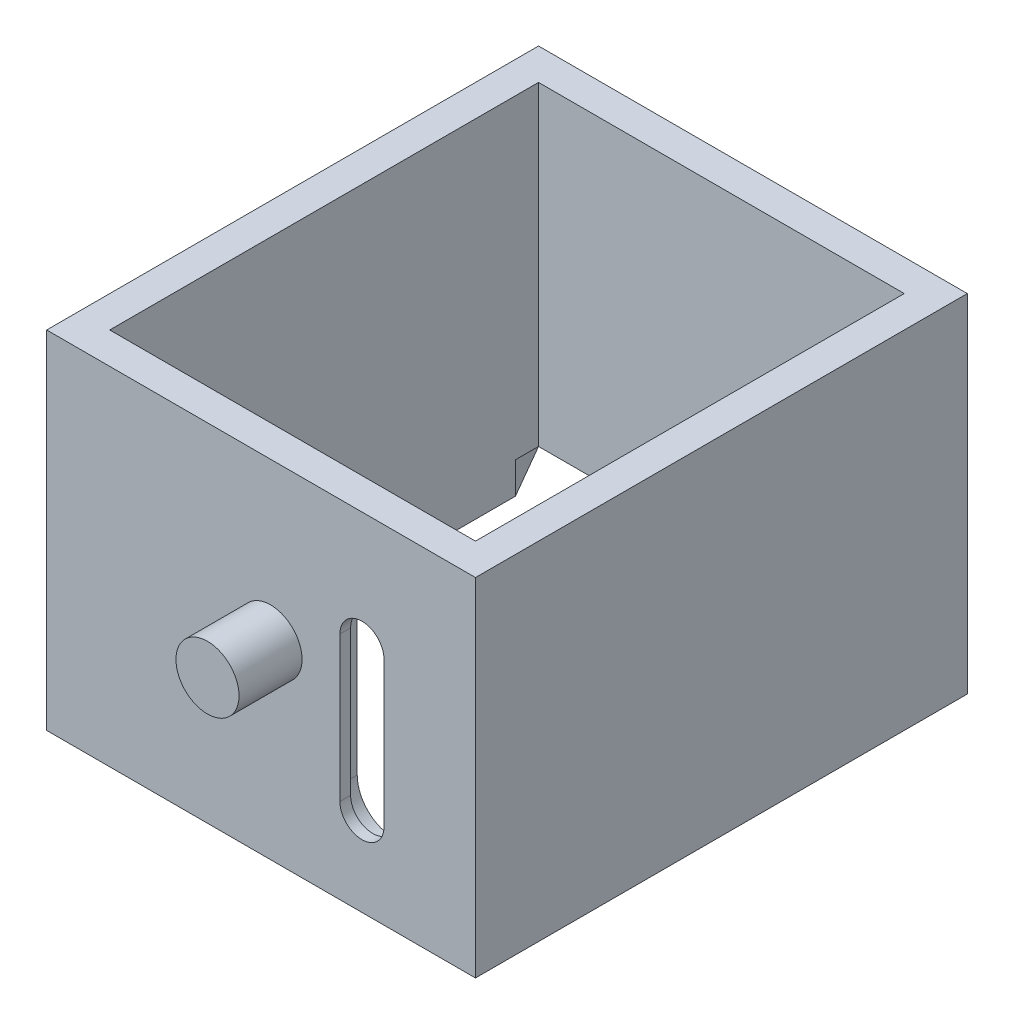
ISO-10303-21;
HEADER;
FILE_DESCRIPTION(('STEP AP214'),'2;1');
FILE_NAME('part.step','',(''),(''),'','','');
FILE_SCHEMA(('AUTOMOTIVE_DESIGN { 1 0 10303 214 1 1 1 1 }'));
ENDSEC;
DATA;
#1=APPLICATION_CONTEXT('core data for automotive mechanical design processes');
#2=APPLICATION_PROTOCOL_DEFINITION('international standard','automotive_design',2000,#1);
#3=PRODUCT_CONTEXT('',#1,'mechanical');
#4=PRODUCT('Part','Part','',(#3));
#5=PRODUCT_RELATED_PRODUCT_CATEGORY('part','',(#4));
#6=PRODUCT_DEFINITION_FORMATION('','',#4);
#7=PRODUCT_DEFINITION_CONTEXT('part definition',#1,'design');
#8=PRODUCT_DEFINITION('design','',#6,#7);
#9=PRODUCT_DEFINITION_SHAPE('','',#8);
#10=(LENGTH_UNIT() NAMED_UNIT(*) SI_UNIT(.MILLI.,.METRE.));
#11=(NAMED_UNIT(*) PLANE_ANGLE_UNIT() SI_UNIT($,.RADIAN.));
#12=(NAMED_UNIT(*) SI_UNIT($,.STERADIAN.) SOLID_ANGLE_UNIT());
#13=UNCERTAINTY_MEASURE_WITH_UNIT(LENGTH_MEASURE(1.E-05),#10,'distance_accuracy_value','');
#14=(GEOMETRIC_REPRESENTATION_CONTEXT(3) GLOBAL_UNCERTAINTY_ASSIGNED_CONTEXT((#13)) GLOBAL_UNIT_ASSIGNED_CONTEXT((#10,
#11,#12)) REPRESENTATION_CONTEXT('',''));
#15=CARTESIAN_POINT('',(0.,0.,0.));
#16=DIRECTION('',(0.,0.,1.));
#17=DIRECTION('',(1.,0.,0.));
#18=AXIS2_PLACEMENT_3D('',#15,#16,#17);
#19=CARTESIAN_POINT('',(0.,0.,0.));
#20=DIRECTION('',(0.,0.,1.));
#21=DIRECTION('',(1.,0.,0.));
#22=AXIS2_PLACEMENT_3D('',#19,#20,#21);
#23=PLANE('',#22);
#24=DIRECTION('',(1.,0.,0.));
#25=VECTOR('',#24,1.);
#26=CARTESIAN_POINT('',(-68.,5.,0.));
#27=LINE('',#26,#25);
#28=CARTESIAN_POINT('',(-68.,5.,0.));
#29=VERTEX_POINT('',#28);
#30=CARTESIAN_POINT('',(0.,5.,0.));
#31=VERTEX_POINT('',#30);
#32=EDGE_CURVE('E244',#29,#31,#27,.T.);
#33=ORIENTED_EDGE('',*,*,#32,.F.);
#34=DIRECTION('',(0.,-1.,0.));
#35=VECTOR('',#34,1.);
#36=CARTESIAN_POINT('',(-68.,55.,0.));
#37=LINE('',#36,#35);
#38=CARTESIAN_POINT('',(-68.,55.,0.));
#39=VERTEX_POINT('',#38);
#40=EDGE_CURVE('E268',#39,#29,#37,.T.);
#41=ORIENTED_EDGE('',*,*,#40,.F.);
#42=DIRECTION('',(-1.,0.,0.));
#43=VECTOR('',#42,1.);
#44=CARTESIAN_POINT('',(-68.,55.,0.));
#45=LINE('',#44,#43);
#46=CARTESIAN_POINT('',(0.,55.,0.));
#47=VERTEX_POINT('',#46);
#48=EDGE_CURVE('E258',#47,#39,#45,.T.);
#49=ORIENTED_EDGE('',*,*,#48,.F.);
#50=DIRECTION('',(0.,1.,0.));
#51=VECTOR('',#50,1.);
#52=CARTESIAN_POINT('',(0.,55.,0.));
#53=LINE('',#52,#51);
#54=EDGE_CURVE('E257',#31,#47,#53,.T.);
#55=ORIENTED_EDGE('',*,*,#54,.F.);
#56=EDGE_LOOP('',(#33,#41,#49,#55));
#57=FACE_BOUND('',#56,.T.);
#58=ADVANCED_FACE('F106',(#57),#23,.F.);
#59=CARTESIAN_POINT('',(-63.,0.,5.));
#60=DIRECTION('',(0.,0.,-1.));
#61=DIRECTION('',(-1.,0.,0.));
#62=AXIS2_PLACEMENT_3D('',#59,#60,#61);
#63=PLANE('',#62);
#64=DIRECTION('',(-1.,0.,0.));
#65=VECTOR('',#64,1.);
#66=CARTESIAN_POINT('',(-63.,5.,5.));
#67=LINE('',#66,#65);
#68=CARTESIAN_POINT('',(-5.,5.,5.));
#69=VERTEX_POINT('',#68);
#70=CARTESIAN_POINT('',(-63.,5.,5.));
#71=VERTEX_POINT('',#70);
#72=EDGE_CURVE('E403',#69,#71,#67,.T.);
#73=ORIENTED_EDGE('',*,*,#72,.F.);
#74=DIRECTION('',(0.,1.,0.));
#75=VECTOR('',#74,1.);
#76=CARTESIAN_POINT('',(-5.,0.,5.));
#77=LINE('',#76,#75);
#78=CARTESIAN_POINT('',(-5.,55.,5.));
#79=VERTEX_POINT('',#78);
#80=EDGE_CURVE('E354',#69,#79,#77,.T.);
#81=ORIENTED_EDGE('',*,*,#80,.T.);
#82=DIRECTION('',(-1.,0.,0.));
#83=VECTOR('',#82,1.);
#84=CARTESIAN_POINT('',(-63.,55.,5.));
#85=LINE('',#84,#83);
#86=CARTESIAN_POINT('',(-63.,55.,5.));
#87=VERTEX_POINT('',#86);
#88=EDGE_CURVE('E337',#79,#87,#85,.T.);
#89=ORIENTED_EDGE('',*,*,#88,.T.);
#90=DIRECTION('',(0.,1.,0.));
#91=VECTOR('',#90,1.);
#92=CARTESIAN_POINT('',(-63.,0.,5.));
#93=LINE('',#92,#91);
#94=EDGE_CURVE('E262',#71,#87,#93,.T.);
#95=ORIENTED_EDGE('',*,*,#94,.F.);
#96=EDGE_LOOP('',(#73,#81,#89,#95));
#97=FACE_BOUND('',#96,.T.);
#98=ADVANCED_FACE('F456',(#97),#63,.F.);
#99=CARTESIAN_POINT('',(-63.,0.,73.));
#100=DIRECTION('',(0.,0.,1.));
#101=DIRECTION('',(1.,0.,0.));
#102=AXIS2_PLACEMENT_3D('',#99,#100,#101);
#103=PLANE('',#102);
#104=DIRECTION('',(1.,0.,0.));
#105=VECTOR('',#104,1.);
#106=CARTESIAN_POINT('',(-63.,55.,73.));
#107=LINE('',#106,#105);
#108=CARTESIAN_POINT('',(-63.,55.,73.));
#109=VERTEX_POINT('',#108);
#110=CARTESIAN_POINT('',(-4.99999999999999,55.,73.));
#111=VERTEX_POINT('',#110);
#112=EDGE_CURVE('E345',#109,#111,#107,.T.);
#113=ORIENTED_EDGE('',*,*,#112,.T.);
#114=DIRECTION('',(0.,1.,0.));
#115=VECTOR('',#114,1.);
#116=CARTESIAN_POINT('',(-4.99999999999999,0.,73.));
#117=LINE('',#116,#115);
#118=CARTESIAN_POINT('',(-4.99999999999999,0.,73.));
#119=VERTEX_POINT('',#118);
#120=EDGE_CURVE('E356',#119,#111,#117,.T.);
#121=ORIENTED_EDGE('',*,*,#120,.F.);
#122=DIRECTION('',(1.,0.,0.));
#123=VECTOR('',#122,1.);
#124=CARTESIAN_POINT('',(-63.,0.,73.));
#125=LINE('',#124,#123);
#126=CARTESIAN_POINT('',(-63.,0.,73.));
#127=VERTEX_POINT('',#126);
#128=EDGE_CURVE('E336',#127,#119,#125,.T.);
#129=ORIENTED_EDGE('',*,*,#128,.F.);
#130=DIRECTION('',(0.,1.,0.));
#131=VECTOR('',#130,1.);
#132=CARTESIAN_POINT('',(-63.,0.,73.));
#133=LINE('',#132,#131);
#134=EDGE_CURVE('E343',#127,#109,#133,.T.);
#135=ORIENTED_EDGE('',*,*,#134,.T.);
#136=EDGE_LOOP('',(#113,#121,#129,#135));
#137=FACE_BOUND('',#136,.T.);
#138=DIRECTION('',(0.,1.,0.));
#139=VECTOR('',#138,1.);
#140=CARTESIAN_POINT('',(-12.25,13.5,73.));
#141=LINE('',#140,#139);
#142=CARTESIAN_POINT('',(-12.25,13.5,73.));
#143=VERTEX_POINT('',#142);
#144=CARTESIAN_POINT('',(-12.25,36.5,73.));
#145=VERTEX_POINT('',#144);
#146=EDGE_CURVE('E418',#143,#145,#141,.T.);
#147=ORIENTED_EDGE('',*,*,#146,.T.);
#148=CARTESIAN_POINT('',(-18.,36.5,73.));
#149=DIRECTION('',(0.,0.,-1.));
#150=DIRECTION('',(-1.,0.,0.));
#151=AXIS2_PLACEMENT_3D('',#148,#149,#150);
#152=CIRCLE('',#151,5.75);
#153=CARTESIAN_POINT('',(-23.7500000000001,36.5,73.));
#154=VERTEX_POINT('',#153);
#155=EDGE_CURVE('E312',#154,#145,#152,.T.);
#156=ORIENTED_EDGE('',*,*,#155,.F.);
#157=DIRECTION('',(0.,1.,0.));
#158=VECTOR('',#157,1.);
#159=CARTESIAN_POINT('',(-23.7500000000001,13.5,73.));
#160=LINE('',#159,#158);
#161=CARTESIAN_POINT('',(-23.75,13.5,73.));
#162=VERTEX_POINT('',#161);
#163=EDGE_CURVE('E407',#162,#154,#160,.T.);
#164=ORIENTED_EDGE('',*,*,#163,.F.);
#165=CARTESIAN_POINT('',(-18.,13.5,73.));
#166=DIRECTION('',(0.,0.,-1.));
#167=DIRECTION('',(-1.,0.,0.));
#168=AXIS2_PLACEMENT_3D('',#165,#166,#167);
#169=CIRCLE('',#168,5.75);
#170=EDGE_CURVE('E128',#143,#162,#169,.T.);
#171=ORIENTED_EDGE('',*,*,#170,.F.);
#172=EDGE_LOOP('',(#147,#156,#164,#171));
#173=FACE_BOUND('',#172,.T.);
#174=ADVANCED_FACE('F393',(#137,#173),#103,.F.);
#175=CARTESIAN_POINT('',(0.,0.,78.));
#176=DIRECTION('',(0.,0.,1.));
#177=DIRECTION('',(1.,0.,0.));
#178=AXIS2_PLACEMENT_3D('',#175,#176,#177);
#179=PLANE('',#178);
#180=CARTESIAN_POINT('',(-32.5,30.,78.));
#181=DIRECTION('',(0.,0.,1.));
#182=DIRECTION('',(1.,0.,0.));
#183=AXIS2_PLACEMENT_3D('',#180,#181,#182);
#184=CIRCLE('',#183,5.);
#185=CARTESIAN_POINT('',(-27.5,30.,78.));
#186=VERTEX_POINT('',#185);
#187=EDGE_CURVE('E327',#186,#186,#184,.T.);
#188=ORIENTED_EDGE('',*,*,#187,.F.);
#189=EDGE_LOOP('',(#188));
#190=FACE_BOUND('',#189,.T.);
#191=DIRECTION('',(0.,1.,0.));
#192=VECTOR('',#191,1.);
#193=CARTESIAN_POINT('',(0.,55.,78.));
#194=LINE('',#193,#192);
#195=CARTESIAN_POINT('',(0.,0.,78.));
#196=VERTEX_POINT('',#195);
#197=CARTESIAN_POINT('',(0.,55.,78.));
#198=VERTEX_POINT('',#197);
#199=EDGE_CURVE('E275',#196,#198,#194,.T.);
#200=ORIENTED_EDGE('',*,*,#199,.T.);
#201=DIRECTION('',(-1.,0.,0.));
#202=VECTOR('',#201,1.);
#203=CARTESIAN_POINT('',(-68.,55.,78.));
#204=LINE('',#203,#202);
#205=CARTESIAN_POINT('',(-68.,55.,78.));
#206=VERTEX_POINT('',#205);
#207=EDGE_CURVE('E362',#198,#206,#204,.T.);
#208=ORIENTED_EDGE('',*,*,#207,.T.);
#209=DIRECTION('',(0.,-1.,0.));
#210=VECTOR('',#209,1.);
#211=CARTESIAN_POINT('',(-68.,55.,78.));
#212=LINE('',#211,#210);
#213=CARTESIAN_POINT('',(-68.,0.,78.));
#214=VERTEX_POINT('',#213);
#215=EDGE_CURVE('E363',#206,#214,#212,.T.);
#216=ORIENTED_EDGE('',*,*,#215,.T.);
#217=DIRECTION('',(1.,0.,0.));
#218=VECTOR('',#217,1.);
#219=CARTESIAN_POINT('',(-68.,0.,78.));
#220=LINE('',#219,#218);
#221=EDGE_CURVE('E271',#214,#196,#220,.T.);
#222=ORIENTED_EDGE('',*,*,#221,.T.);
#223=EDGE_LOOP('',(#200,#208,#216,#222));
#224=FACE_BOUND('',#223,.T.);
#225=CARTESIAN_POINT('',(-18.,36.5,78.));
#226=DIRECTION('',(0.,0.,1.));
#227=DIRECTION('',(1.,0.,0.));
#228=AXIS2_PLACEMENT_3D('',#225,#226,#227);
#229=CIRCLE('',#228,3.5);
#230=CARTESIAN_POINT('',(-14.5,36.5,78.));
#231=VERTEX_POINT('',#230);
#232=CARTESIAN_POINT('',(-21.5,36.5,78.));
#233=VERTEX_POINT('',#232);
#234=EDGE_CURVE('E290',#231,#233,#229,.T.);
#235=ORIENTED_EDGE('',*,*,#234,.F.);
#236=DIRECTION('',(0.,-1.,0.));
#237=VECTOR('',#236,1.);
#238=CARTESIAN_POINT('',(-14.5,0.,78.));
#239=LINE('',#238,#237);
#240=CARTESIAN_POINT('',(-14.5,13.5,78.));
#241=VERTEX_POINT('',#240);
#242=EDGE_CURVE('E114',#231,#241,#239,.T.);
#243=ORIENTED_EDGE('',*,*,#242,.T.);
#244=CARTESIAN_POINT('',(-18.,13.5,78.));
#245=DIRECTION('',(0.,0.,1.));
#246=DIRECTION('',(1.,0.,0.));
#247=AXIS2_PLACEMENT_3D('',#244,#245,#246);
#248=CIRCLE('',#247,3.5);
#249=CARTESIAN_POINT('',(-21.5,13.5,78.));
#250=VERTEX_POINT('',#249);
#251=EDGE_CURVE('E288',#250,#241,#248,.T.);
#252=ORIENTED_EDGE('',*,*,#251,.F.);
#253=DIRECTION('',(0.,-1.,0.));
#254=VECTOR('',#253,1.);
#255=CARTESIAN_POINT('',(-21.5,0.,78.));
#256=LINE('',#255,#254);
#257=EDGE_CURVE('E285',#233,#250,#256,.T.);
#258=ORIENTED_EDGE('',*,*,#257,.F.);
#259=EDGE_LOOP('',(#235,#243,#252,#258));
#260=FACE_BOUND('',#259,.T.);
#261=ADVANCED_FACE('F295',(#190,#224,#260),#179,.T.);
#262=CARTESIAN_POINT('',(0.,55.,78.));
#263=DIRECTION('',(-1.,0.,0.));
#264=DIRECTION('',(0.,-1.,0.));
#265=AXIS2_PLACEMENT_3D('',#262,#263,#264);
#266=PLANE('',#265);
#267=CARTESIAN_POINT('',(0.,0.,0.));
#268=VERTEX_POINT('',#267);
#269=EDGE_CURVE('E238',#268,#31,#53,.T.);
#270=ORIENTED_EDGE('',*,*,#269,.T.);
#271=ORIENTED_EDGE('',*,*,#54,.T.);
#272=DIRECTION('',(0.,0.,-1.));
#273=VECTOR('',#272,1.);
#274=CARTESIAN_POINT('',(0.,55.,78.));
#275=LINE('',#274,#273);
#276=EDGE_CURVE('E283',#198,#47,#275,.T.);
#277=ORIENTED_EDGE('',*,*,#276,.F.);
#278=ORIENTED_EDGE('',*,*,#199,.F.);
#279=DIRECTION('',(0.,0.,-1.));
#280=VECTOR('',#279,1.);
#281=CARTESIAN_POINT('',(0.,0.,78.));
#282=LINE('',#281,#280);
#283=EDGE_CURVE('E267',#196,#268,#282,.T.);
#284=ORIENTED_EDGE('',*,*,#283,.T.);
#285=EDGE_LOOP('',(#270,#271,#277,#278,#284));
#286=FACE_BOUND('',#285,.T.);
#287=ADVANCED_FACE('F108',(#286),#266,.F.);
#288=CARTESIAN_POINT('',(-68.,55.,78.));
#289=DIRECTION('',(0.,-1.,0.));
#290=DIRECTION('',(0.,0.,-1.));
#291=AXIS2_PLACEMENT_3D('',#288,#289,#290);
#292=PLANE('',#291);
#293=ORIENTED_EDGE('',*,*,#112,.F.);
#294=DIRECTION('',(0.,0.,1.));
#295=VECTOR('',#294,1.);
#296=CARTESIAN_POINT('',(-63.,55.,5.));
#297=LINE('',#296,#295);
#298=EDGE_CURVE('E331',#87,#109,#297,.T.);
#299=ORIENTED_EDGE('',*,*,#298,.F.);
#300=ORIENTED_EDGE('',*,*,#88,.F.);
#301=DIRECTION('',(0.,0.,-1.));
#302=VECTOR('',#301,1.);
#303=CARTESIAN_POINT('',(-5.,55.,5.));
#304=LINE('',#303,#302);
#305=EDGE_CURVE('E348',#111,#79,#304,.T.);
#306=ORIENTED_EDGE('',*,*,#305,.F.);
#307=EDGE_LOOP('',(#293,#299,#300,#306));
#308=FACE_BOUND('',#307,.T.);
#309=ORIENTED_EDGE('',*,*,#48,.T.);
#310=DIRECTION('',(0.,0.,-1.));
#311=VECTOR('',#310,1.);
#312=CARTESIAN_POINT('',(-68.,55.,78.));
#313=LINE('',#312,#311);
#314=EDGE_CURVE('E280',#206,#39,#313,.T.);
#315=ORIENTED_EDGE('',*,*,#314,.F.);
#316=ORIENTED_EDGE('',*,*,#207,.F.);
#317=ORIENTED_EDGE('',*,*,#276,.T.);
#318=EDGE_LOOP('',(#309,#315,#316,#317));
#319=FACE_BOUND('',#318,.T.);
#320=ADVANCED_FACE('F372',(#308,#319),#292,.F.);
#321=CARTESIAN_POINT('',(-68.,55.,78.));
#322=DIRECTION('',(1.,0.,0.));
#323=DIRECTION('',(0.,0.,-1.));
#324=AXIS2_PLACEMENT_3D('',#321,#322,#323);
#325=PLANE('',#324);
#326=ORIENTED_EDGE('',*,*,#40,.T.);
#327=DIRECTION('',(0.,-1.,0.));
#328=VECTOR('',#327,1.);
#329=CARTESIAN_POINT('',(-68.,5.,0.));
#330=LINE('',#329,#328);
#331=CARTESIAN_POINT('',(-68.,0.,0.));
#332=VERTEX_POINT('',#331);
#333=EDGE_CURVE('E377',#29,#332,#330,.T.);
#334=ORIENTED_EDGE('',*,*,#333,.T.);
#335=DIRECTION('',(0.,0.,-1.));
#336=VECTOR('',#335,1.);
#337=CARTESIAN_POINT('',(-68.,0.,78.));
#338=LINE('',#337,#336);
#339=EDGE_CURVE('E277',#214,#332,#338,.T.);
#340=ORIENTED_EDGE('',*,*,#339,.F.);
#341=ORIENTED_EDGE('',*,*,#215,.F.);
#342=ORIENTED_EDGE('',*,*,#314,.T.);
#343=EDGE_LOOP('',(#326,#334,#340,#341,#342));
#344=FACE_BOUND('',#343,.T.);
#345=ADVANCED_FACE('F375',(#344),#325,.F.);
#346=CARTESIAN_POINT('',(-68.,0.,78.));
#347=DIRECTION('',(0.,1.,0.));
#348=DIRECTION('',(0.,0.,1.));
#349=AXIS2_PLACEMENT_3D('',#346,#347,#348);
#350=PLANE('',#349);
#351=ORIENTED_EDGE('',*,*,#339,.T.);
#352=DIRECTION('',(-0.5,0.,-0.866025403784438));
#353=VECTOR('',#352,1.);
#354=CARTESIAN_POINT('',(-63.,0.,8.66025403784439));
#355=LINE('',#354,#353);
#356=CARTESIAN_POINT('',(-63.,0.,8.66025403784439));
#357=VERTEX_POINT('',#356);
#358=EDGE_CURVE('E254',#357,#332,#355,.T.);
#359=ORIENTED_EDGE('',*,*,#358,.F.);
#360=DIRECTION('',(0.,0.,1.));
#361=VECTOR('',#360,1.);
#362=CARTESIAN_POINT('',(-63.,0.,5.));
#363=LINE('',#362,#361);
#364=EDGE_CURVE('E334',#357,#127,#363,.T.);
#365=ORIENTED_EDGE('',*,*,#364,.T.);
#366=ORIENTED_EDGE('',*,*,#128,.T.);
#367=DIRECTION('',(0.,0.,-1.));
#368=VECTOR('',#367,1.);
#369=CARTESIAN_POINT('',(-5.,0.,5.));
#370=LINE('',#369,#368);
#371=CARTESIAN_POINT('',(-4.99999999999999,0.,8.66025403784439));
#372=VERTEX_POINT('',#371);
#373=EDGE_CURVE('E340',#119,#372,#370,.T.);
#374=ORIENTED_EDGE('',*,*,#373,.T.);
#375=DIRECTION('',(-0.499999999999999,0.,0.866025403784439));
#376=VECTOR('',#375,1.);
#377=CARTESIAN_POINT('',(0.,0.,0.));
#378=LINE('',#377,#376);
#379=EDGE_CURVE('E370',#268,#372,#378,.T.);
#380=ORIENTED_EDGE('',*,*,#379,.F.);
#381=ORIENTED_EDGE('',*,*,#283,.F.);
#382=ORIENTED_EDGE('',*,*,#221,.F.);
#383=EDGE_LOOP('',(#351,#359,#365,#366,#374,#380,#381,#382));
#384=FACE_BOUND('',#383,.T.);
#385=ADVANCED_FACE('F369',(#384),#350,.F.);
#386=CARTESIAN_POINT('',(-63.,0.,5.));
#387=DIRECTION('',(-1.,0.,0.));
#388=DIRECTION('',(0.,0.,1.));
#389=AXIS2_PLACEMENT_3D('',#386,#387,#388);
#390=PLANE('',#389);
#391=ORIENTED_EDGE('',*,*,#364,.F.);
#392=DIRECTION('',(0.,-1.,0.));
#393=VECTOR('',#392,1.);
#394=CARTESIAN_POINT('',(-63.,5.,8.66025403784439));
#395=LINE('',#394,#393);
#396=CARTESIAN_POINT('',(-63.,5.,8.66025403784439));
#397=VERTEX_POINT('',#396);
#398=EDGE_CURVE('E387',#397,#357,#395,.T.);
#399=ORIENTED_EDGE('',*,*,#398,.F.);
#400=DIRECTION('',(0.,0.,1.));
#401=VECTOR('',#400,1.);
#402=CARTESIAN_POINT('',(-63.,5.,5.));
#403=LINE('',#402,#401);
#404=EDGE_CURVE('E405',#71,#397,#403,.T.);
#405=ORIENTED_EDGE('',*,*,#404,.F.);
#406=ORIENTED_EDGE('',*,*,#94,.T.);
#407=ORIENTED_EDGE('',*,*,#298,.T.);
#408=ORIENTED_EDGE('',*,*,#134,.F.);
#409=EDGE_LOOP('',(#391,#399,#405,#406,#407,#408));
#410=FACE_BOUND('',#409,.T.);
#411=ADVANCED_FACE('F385',(#410),#390,.F.);
#412=CARTESIAN_POINT('',(-5.,0.,5.));
#413=DIRECTION('',(1.,0.,0.));
#414=DIRECTION('',(0.,0.,-1.));
#415=AXIS2_PLACEMENT_3D('',#412,#413,#414);
#416=PLANE('',#415);
#417=DIRECTION('',(0.,0.,-1.));
#418=VECTOR('',#417,1.);
#419=CARTESIAN_POINT('',(-5.,5.,5.));
#420=LINE('',#419,#418);
#421=CARTESIAN_POINT('',(-5.,5.,8.66025403784439));
#422=VERTEX_POINT('',#421);
#423=EDGE_CURVE('E13',#422,#69,#420,.T.);
#424=ORIENTED_EDGE('',*,*,#423,.F.);
#425=DIRECTION('',(0.,-1.,0.));
#426=VECTOR('',#425,1.);
#427=CARTESIAN_POINT('',(-4.99999999999999,5.,8.66025403784439));
#428=LINE('',#427,#426);
#429=EDGE_CURVE('E241',#422,#372,#428,.T.);
#430=ORIENTED_EDGE('',*,*,#429,.T.);
#431=ORIENTED_EDGE('',*,*,#373,.F.);
#432=ORIENTED_EDGE('',*,*,#120,.T.);
#433=ORIENTED_EDGE('',*,*,#305,.T.);
#434=ORIENTED_EDGE('',*,*,#80,.F.);
#435=EDGE_LOOP('',(#424,#430,#431,#432,#433,#434));
#436=FACE_BOUND('',#435,.T.);
#437=ADVANCED_FACE('F396',(#436),#416,.F.);
#438=CARTESIAN_POINT('',(-32.5,30.,88.));
#439=DIRECTION('',(0.,0.,-1.));
#440=DIRECTION('',(-1.,0.,0.));
#441=AXIS2_PLACEMENT_3D('',#438,#439,#440);
#442=CYLINDRICAL_SURFACE('',#441,5.);
#443=CARTESIAN_POINT('',(-32.5,30.,88.));
#444=DIRECTION('',(0.,0.,1.));
#445=DIRECTION('',(1.,0.,0.));
#446=AXIS2_PLACEMENT_3D('',#443,#444,#445);
#447=CIRCLE('',#446,5.);
#448=CARTESIAN_POINT('',(-27.5,30.,88.));
#449=VERTEX_POINT('',#448);
#450=EDGE_CURVE('E328',#449,#449,#447,.T.);
#451=ORIENTED_EDGE('',*,*,#450,.F.);
#452=EDGE_LOOP('',(#451));
#453=FACE_BOUND('',#452,.T.);
#454=ORIENTED_EDGE('',*,*,#187,.T.);
#455=EDGE_LOOP('',(#454));
#456=FACE_BOUND('',#455,.T.);
#457=ADVANCED_FACE('F518',(#453,#456),#442,.T.);
#458=CARTESIAN_POINT('',(-32.5,30.,88.));
#459=DIRECTION('',(0.,0.,1.));
#460=DIRECTION('',(1.,0.,0.));
#461=AXIS2_PLACEMENT_3D('',#458,#459,#460);
#462=PLANE('',#461);
#463=ORIENTED_EDGE('',*,*,#450,.T.);
#464=EDGE_LOOP('',(#463));
#465=FACE_BOUND('',#464,.T.);
#466=ADVANCED_FACE('F451',(#465),#462,.T.);
#467=CARTESIAN_POINT('',(-18.,36.5,73.));
#468=DIRECTION('',(0.,0.,-1.));
#469=DIRECTION('',(-1.,0.,0.));
#470=AXIS2_PLACEMENT_3D('',#467,#468,#469);
#471=CYLINDRICAL_SURFACE('',#470,3.5);
#472=ORIENTED_EDGE('',*,*,#234,.T.);
#473=DIRECTION('',(0.,0.,-1.));
#474=VECTOR('',#473,1.);
#475=CARTESIAN_POINT('',(-21.5,36.5,73.));
#476=LINE('',#475,#474);
#477=CARTESIAN_POINT('',(-21.5,36.5,76.3));
#478=VERTEX_POINT('',#477);
#479=EDGE_CURVE('E317',#478,#233,#476,.F.);
#480=ORIENTED_EDGE('',*,*,#479,.F.);
#481=CARTESIAN_POINT('',(-18.,36.5,76.3));
#482=DIRECTION('',(0.,0.,-1.));
#483=DIRECTION('',(-1.,0.,0.));
#484=AXIS2_PLACEMENT_3D('',#481,#482,#483);
#485=CIRCLE('',#484,3.5);
#486=CARTESIAN_POINT('',(-14.5,36.5,76.3));
#487=VERTEX_POINT('',#486);
#488=EDGE_CURVE('E311',#478,#487,#485,.T.);
#489=ORIENTED_EDGE('',*,*,#488,.T.);
#490=DIRECTION('',(0.,0.,1.));
#491=VECTOR('',#490,1.);
#492=CARTESIAN_POINT('',(-14.5,36.5,78.001));
#493=LINE('',#492,#491);
#494=EDGE_CURVE('E302',#487,#231,#493,.T.);
#495=ORIENTED_EDGE('',*,*,#494,.T.);
#496=EDGE_LOOP('',(#472,#480,#489,#495));
#497=FACE_BOUND('',#496,.T.);
#498=ADVANCED_FACE('F307',(#497),#471,.F.);
#499=CARTESIAN_POINT('',(-18.,13.5,73.));
#500=DIRECTION('',(0.,0.,-1.));
#501=DIRECTION('',(-1.,0.,0.));
#502=AXIS2_PLACEMENT_3D('',#499,#500,#501);
#503=CYLINDRICAL_SURFACE('',#502,3.5);
#504=ORIENTED_EDGE('',*,*,#251,.T.);
#505=DIRECTION('',(0.,0.,1.));
#506=VECTOR('',#505,1.);
#507=CARTESIAN_POINT('',(-14.5,13.5,78.001));
#508=LINE('',#507,#506);
#509=CARTESIAN_POINT('',(-14.5,13.5,76.3));
#510=VERTEX_POINT('',#509);
#511=EDGE_CURVE('E304',#510,#241,#508,.T.);
#512=ORIENTED_EDGE('',*,*,#511,.F.);
#513=CARTESIAN_POINT('',(-18.,13.5,76.3));
#514=DIRECTION('',(0.,0.,-1.));
#515=DIRECTION('',(-1.,0.,0.));
#516=AXIS2_PLACEMENT_3D('',#513,#514,#515);
#517=CIRCLE('',#516,3.5);
#518=CARTESIAN_POINT('',(-21.5,13.5,76.3));
#519=VERTEX_POINT('',#518);
#520=EDGE_CURVE('E431',#510,#519,#517,.T.);
#521=ORIENTED_EDGE('',*,*,#520,.T.);
#522=DIRECTION('',(0.,0.,-1.));
#523=VECTOR('',#522,1.);
#524=CARTESIAN_POINT('',(-21.5,13.5,73.));
#525=LINE('',#524,#523);
#526=EDGE_CURVE('E421',#250,#519,#525,.T.);
#527=ORIENTED_EDGE('',*,*,#526,.F.);
#528=EDGE_LOOP('',(#504,#512,#521,#527));
#529=FACE_BOUND('',#528,.T.);
#530=ADVANCED_FACE('F443',(#529),#503,.F.);
#531=CARTESIAN_POINT('',(-14.5,13.5,78.001));
#532=DIRECTION('',(-1.,0.,0.));
#533=DIRECTION('',(0.,0.,1.));
#534=AXIS2_PLACEMENT_3D('',#531,#532,#533);
#535=PLANE('',#534);
#536=ORIENTED_EDGE('',*,*,#494,.F.);
#537=DIRECTION('',(0.,1.,0.));
#538=VECTOR('',#537,1.);
#539=CARTESIAN_POINT('',(-14.5,13.5,76.3));
#540=LINE('',#539,#538);
#541=EDGE_CURVE('E413',#510,#487,#540,.T.);
#542=ORIENTED_EDGE('',*,*,#541,.F.);
#543=ORIENTED_EDGE('',*,*,#511,.T.);
#544=ORIENTED_EDGE('',*,*,#242,.F.);
#545=EDGE_LOOP('',(#536,#542,#543,#544));
#546=FACE_BOUND('',#545,.T.);
#547=ADVANCED_FACE('F301',(#546),#535,.T.);
#548=CARTESIAN_POINT('',(-21.5,13.5,73.));
#549=DIRECTION('',(-1.,0.,0.));
#550=DIRECTION('',(0.,0.,1.));
#551=AXIS2_PLACEMENT_3D('',#548,#549,#550);
#552=PLANE('',#551);
#553=ORIENTED_EDGE('',*,*,#257,.T.);
#554=ORIENTED_EDGE('',*,*,#526,.T.);
#555=DIRECTION('',(0.,1.,0.));
#556=VECTOR('',#555,1.);
#557=CARTESIAN_POINT('',(-21.5,13.5,76.3));
#558=LINE('',#557,#556);
#559=EDGE_CURVE('E411',#519,#478,#558,.T.);
#560=ORIENTED_EDGE('',*,*,#559,.T.);
#561=ORIENTED_EDGE('',*,*,#479,.T.);
#562=EDGE_LOOP('',(#553,#554,#560,#561));
#563=FACE_BOUND('',#562,.T.);
#564=ADVANCED_FACE('F436',(#563),#552,.F.);
#565=CARTESIAN_POINT('',(-14.5,36.5,76.3));
#566=DIRECTION('',(0.,0.,1.));
#567=DIRECTION('',(1.,0.,0.));
#568=AXIS2_PLACEMENT_3D('',#565,#566,#567);
#569=PLANE('',#568);
#570=ORIENTED_EDGE('',*,*,#488,.F.);
#571=ORIENTED_EDGE('',*,*,#559,.F.);
#572=ORIENTED_EDGE('',*,*,#520,.F.);
#573=ORIENTED_EDGE('',*,*,#541,.T.);
#574=EDGE_LOOP('',(#570,#571,#572,#573));
#575=FACE_BOUND('',#574,.T.);
#576=CARTESIAN_POINT('',(-18.,36.5,76.3));
#577=DIRECTION('',(0.,0.,-1.));
#578=DIRECTION('',(-1.,0.,0.));
#579=AXIS2_PLACEMENT_3D('',#576,#577,#578);
#580=CIRCLE('',#579,5.75);
#581=CARTESIAN_POINT('',(-23.75,36.5,76.3));
#582=VERTEX_POINT('',#581);
#583=CARTESIAN_POINT('',(-12.25,36.5,76.3));
#584=VERTEX_POINT('',#583);
#585=EDGE_CURVE('E315',#582,#584,#580,.T.);
#586=ORIENTED_EDGE('',*,*,#585,.T.);
#587=DIRECTION('',(0.,1.,0.));
#588=VECTOR('',#587,1.);
#589=CARTESIAN_POINT('',(-12.25,13.5,76.3));
#590=LINE('',#589,#588);
#591=CARTESIAN_POINT('',(-12.25,13.5,76.3));
#592=VERTEX_POINT('',#591);
#593=EDGE_CURVE('E415',#592,#584,#590,.T.);
#594=ORIENTED_EDGE('',*,*,#593,.F.);
#595=CARTESIAN_POINT('',(-18.,13.5,76.3));
#596=DIRECTION('',(0.,0.,-1.));
#597=DIRECTION('',(-1.,0.,0.));
#598=AXIS2_PLACEMENT_3D('',#595,#596,#597);
#599=CIRCLE('',#598,5.75);
#600=CARTESIAN_POINT('',(-23.75,13.5,76.3));
#601=VERTEX_POINT('',#600);
#602=EDGE_CURVE('E428',#592,#601,#599,.T.);
#603=ORIENTED_EDGE('',*,*,#602,.T.);
#604=DIRECTION('',(0.,1.,0.));
#605=VECTOR('',#604,1.);
#606=CARTESIAN_POINT('',(-23.75,13.5,76.3));
#607=LINE('',#606,#605);
#608=EDGE_CURVE('E409',#601,#582,#607,.T.);
#609=ORIENTED_EDGE('',*,*,#608,.T.);
#610=EDGE_LOOP('',(#586,#594,#603,#609));
#611=FACE_BOUND('',#610,.T.);
#612=ADVANCED_FACE('F439',(#575,#611),#569,.F.);
#613=CARTESIAN_POINT('',(-18.,36.5,73.));
#614=DIRECTION('',(0.,0.,-1.));
#615=DIRECTION('',(-1.,0.,0.));
#616=AXIS2_PLACEMENT_3D('',#613,#614,#615);
#617=CYLINDRICAL_SURFACE('',#616,5.75);
#618=ORIENTED_EDGE('',*,*,#155,.T.);
#619=DIRECTION('',(0.,0.,1.));
#620=VECTOR('',#619,1.);
#621=CARTESIAN_POINT('',(-12.25,36.5,76.3));
#622=LINE('',#621,#620);
#623=EDGE_CURVE('E313',#145,#584,#622,.T.);
#624=ORIENTED_EDGE('',*,*,#623,.T.);
#625=ORIENTED_EDGE('',*,*,#585,.F.);
#626=DIRECTION('',(0.,0.,-1.));
#627=VECTOR('',#626,1.);
#628=CARTESIAN_POINT('',(-23.75,36.5,73.));
#629=LINE('',#628,#627);
#630=EDGE_CURVE('E324',#154,#582,#629,.F.);
#631=ORIENTED_EDGE('',*,*,#630,.F.);
#632=EDGE_LOOP('',(#618,#624,#625,#631));
#633=FACE_BOUND('',#632,.T.);
#634=ADVANCED_FACE('F500',(#633),#617,.F.);
#635=CARTESIAN_POINT('',(-18.,13.5,73.));
#636=DIRECTION('',(0.,0.,-1.));
#637=DIRECTION('',(-1.,0.,0.));
#638=AXIS2_PLACEMENT_3D('',#635,#636,#637);
#639=CYLINDRICAL_SURFACE('',#638,5.75);
#640=ORIENTED_EDGE('',*,*,#602,.F.);
#641=DIRECTION('',(0.,0.,1.));
#642=VECTOR('',#641,1.);
#643=CARTESIAN_POINT('',(-12.25,13.5,76.3));
#644=LINE('',#643,#642);
#645=EDGE_CURVE('E423',#143,#592,#644,.T.);
#646=ORIENTED_EDGE('',*,*,#645,.F.);
#647=ORIENTED_EDGE('',*,*,#170,.T.);
#648=DIRECTION('',(0.,0.,-1.));
#649=VECTOR('',#648,1.);
#650=CARTESIAN_POINT('',(-23.75,13.5,73.));
#651=LINE('',#650,#649);
#652=EDGE_CURVE('E434',#601,#162,#651,.T.);
#653=ORIENTED_EDGE('',*,*,#652,.F.);
#654=EDGE_LOOP('',(#640,#646,#647,#653));
#655=FACE_BOUND('',#654,.T.);
#656=ADVANCED_FACE('F497',(#655),#639,.F.);
#657=CARTESIAN_POINT('',(-12.25,13.5,76.3));
#658=DIRECTION('',(-1.,0.,0.));
#659=DIRECTION('',(0.,0.,1.));
#660=AXIS2_PLACEMENT_3D('',#657,#658,#659);
#661=PLANE('',#660);
#662=ORIENTED_EDGE('',*,*,#623,.F.);
#663=ORIENTED_EDGE('',*,*,#146,.F.);
#664=ORIENTED_EDGE('',*,*,#645,.T.);
#665=ORIENTED_EDGE('',*,*,#593,.T.);
#666=EDGE_LOOP('',(#662,#663,#664,#665));
#667=FACE_BOUND('',#666,.T.);
#668=ADVANCED_FACE('F492',(#667),#661,.T.);
#669=CARTESIAN_POINT('',(-23.75,13.5,73.));
#670=DIRECTION('',(-1.,0.,0.));
#671=DIRECTION('',(0.,0.,1.));
#672=AXIS2_PLACEMENT_3D('',#669,#670,#671);
#673=PLANE('',#672);
#674=ORIENTED_EDGE('',*,*,#630,.T.);
#675=ORIENTED_EDGE('',*,*,#608,.F.);
#676=ORIENTED_EDGE('',*,*,#652,.T.);
#677=ORIENTED_EDGE('',*,*,#163,.T.);
#678=EDGE_LOOP('',(#674,#675,#676,#677));
#679=FACE_BOUND('',#678,.T.);
#680=ADVANCED_FACE('F487',(#679),#673,.F.);
#681=CARTESIAN_POINT('',(0.,5.,0.));
#682=DIRECTION('',(0.,-1.,0.));
#683=DIRECTION('',(0.,0.,-1.));
#684=AXIS2_PLACEMENT_3D('',#681,#682,#683);
#685=PLANE('',#684);
#686=ORIENTED_EDGE('',*,*,#404,.T.);
#687=DIRECTION('',(-0.5,0.,-0.866025403784438));
#688=VECTOR('',#687,1.);
#689=CARTESIAN_POINT('',(-63.,5.,8.66025403784439));
#690=LINE('',#689,#688);
#691=EDGE_CURVE('E243',#397,#29,#690,.T.);
#692=ORIENTED_EDGE('',*,*,#691,.T.);
#693=ORIENTED_EDGE('',*,*,#32,.T.);
#694=DIRECTION('',(-0.499999999999999,0.,0.866025403784439));
#695=VECTOR('',#694,1.);
#696=CARTESIAN_POINT('',(0.,5.,0.));
#697=LINE('',#696,#695);
#698=EDGE_CURVE('E120',#31,#422,#697,.T.);
#699=ORIENTED_EDGE('',*,*,#698,.T.);
#700=ORIENTED_EDGE('',*,*,#423,.T.);
#701=ORIENTED_EDGE('',*,*,#72,.T.);
#702=EDGE_LOOP('',(#686,#692,#693,#699,#700,#701));
#703=FACE_BOUND('',#702,.T.);
#704=ADVANCED_FACE('F249',(#703),#685,.T.);
#705=CARTESIAN_POINT('',(-63.,5.,8.66025403784439));
#706=DIRECTION('',(-0.866025403784438,0.,0.5));
#707=DIRECTION('',(0.5,0.,0.866025403784438));
#708=AXIS2_PLACEMENT_3D('',#705,#706,#707);
#709=PLANE('',#708);
#710=ORIENTED_EDGE('',*,*,#358,.T.);
#711=ORIENTED_EDGE('',*,*,#333,.F.);
#712=ORIENTED_EDGE('',*,*,#691,.F.);
#713=ORIENTED_EDGE('',*,*,#398,.T.);
#714=EDGE_LOOP('',(#710,#711,#712,#713));
#715=FACE_BOUND('',#714,.T.);
#716=ADVANCED_FACE('F478',(#715),#709,.F.);
#717=CARTESIAN_POINT('',(0.,5.,0.));
#718=DIRECTION('',(0.866025403784439,0.,0.499999999999999));
#719=DIRECTION('',(0.499999999999999,0.,-0.866025403784439));
#720=AXIS2_PLACEMENT_3D('',#717,#718,#719);
#721=PLANE('',#720);
#722=ORIENTED_EDGE('',*,*,#379,.T.);
#723=ORIENTED_EDGE('',*,*,#429,.F.);
#724=ORIENTED_EDGE('',*,*,#698,.F.);
#725=ORIENTED_EDGE('',*,*,#269,.F.);
#726=EDGE_LOOP('',(#722,#723,#724,#725));
#727=FACE_BOUND('',#726,.T.);
#728=ADVANCED_FACE('F236',(#727),#721,.F.);
#729=CLOSED_SHELL('',(#58,#98,#174,#261,#287,#320,#345,#385,#411,#437,#457,#466,#498,#530,#547,
#564,#612,#634,#656,#668,#680,#704,#716,#728));
#730=MANIFOLD_SOLID_BREP('B2',#729);
#731=ADVANCED_BREP_SHAPE_REPRESENTATION('',(#18,#730),#14);
#732=SHAPE_DEFINITION_REPRESENTATION(#9,#731);
ENDSEC;
END-ISO-10303-21;
